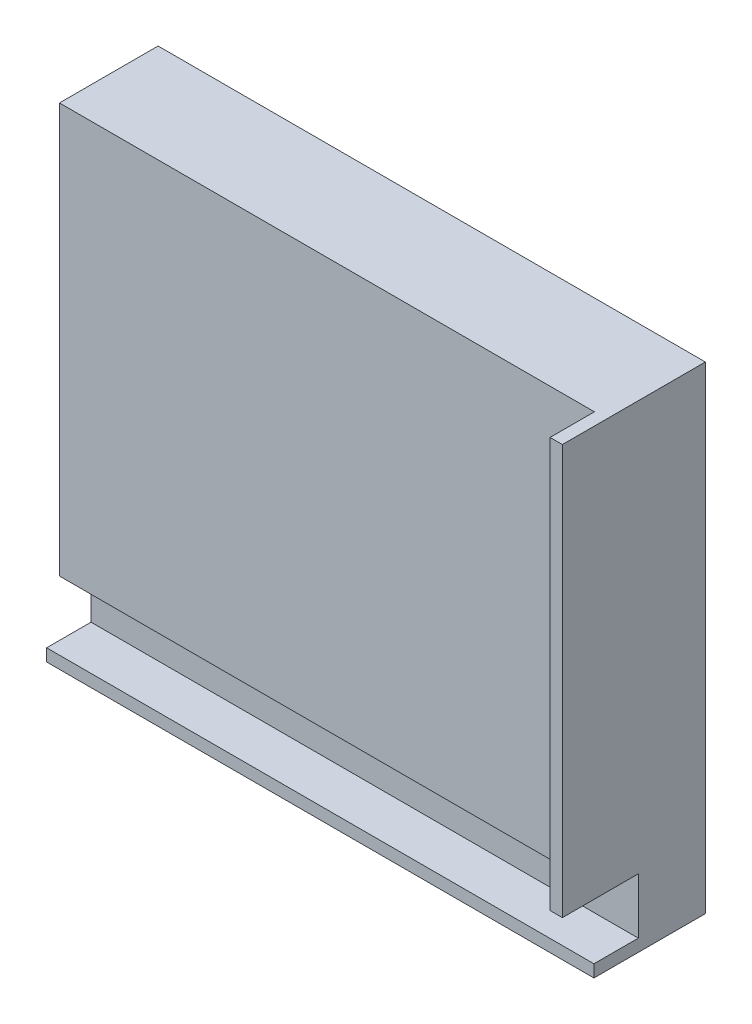
ISO-10303-21;
HEADER;
FILE_DESCRIPTION(('STEP AP214'),'2;1');
FILE_NAME('part.step','',(''),(''),'','','');
FILE_SCHEMA(('AUTOMOTIVE_DESIGN { 1 0 10303 214 1 1 1 1 }'));
ENDSEC;
DATA;
#1=APPLICATION_CONTEXT('core data for automotive mechanical design processes');
#2=APPLICATION_PROTOCOL_DEFINITION('international standard','automotive_design',2000,#1);
#3=PRODUCT_CONTEXT('',#1,'mechanical');
#4=PRODUCT('Part','Part','',(#3));
#5=PRODUCT_RELATED_PRODUCT_CATEGORY('part','',(#4));
#6=PRODUCT_DEFINITION_FORMATION('','',#4);
#7=PRODUCT_DEFINITION_CONTEXT('part definition',#1,'design');
#8=PRODUCT_DEFINITION('design','',#6,#7);
#9=PRODUCT_DEFINITION_SHAPE('','',#8);
#10=(LENGTH_UNIT() NAMED_UNIT(*) SI_UNIT(.MILLI.,.METRE.));
#11=(NAMED_UNIT(*) PLANE_ANGLE_UNIT() SI_UNIT($,.RADIAN.));
#12=(NAMED_UNIT(*) SI_UNIT($,.STERADIAN.) SOLID_ANGLE_UNIT());
#13=UNCERTAINTY_MEASURE_WITH_UNIT(LENGTH_MEASURE(1.E-05),#10,'distance_accuracy_value','');
#14=(GEOMETRIC_REPRESENTATION_CONTEXT(3) GLOBAL_UNCERTAINTY_ASSIGNED_CONTEXT((#13)) GLOBAL_UNIT_ASSIGNED_CONTEXT((#10,
#11,#12)) REPRESENTATION_CONTEXT('',''));
#15=CARTESIAN_POINT('',(0.,0.,0.));
#16=DIRECTION('',(0.,0.,1.));
#17=DIRECTION('',(1.,0.,0.));
#18=AXIS2_PLACEMENT_3D('',#15,#16,#17);
#19=CARTESIAN_POINT('',(72.5968292682926,25.1026341463416,36.83));
#20=DIRECTION('',(0.,-1.,0.));
#21=DIRECTION('',(0.,0.,-1.));
#22=AXIS2_PLACEMENT_3D('',#19,#20,#21);
#23=PLANE('',#22);
#24=DIRECTION('',(0.,0.,1.));
#25=VECTOR('',#24,1.);
#26=CARTESIAN_POINT('',(72.6068292682926,25.1026341463416,36.84));
#27=LINE('',#26,#25);
#28=CARTESIAN_POINT('',(72.6068292682926,25.1026341463416,0.));
#29=VERTEX_POINT('',#28);
#30=CARTESIAN_POINT('',(72.6068292682926,25.1026341463416,25.4));
#31=VERTEX_POINT('',#30);
#32=EDGE_CURVE('E41',#29,#31,#27,.T.);
#33=ORIENTED_EDGE('',*,*,#32,.T.);
#34=DIRECTION('',(1.,0.,0.));
#35=VECTOR('',#34,1.);
#36=CARTESIAN_POINT('',(0.,25.1026341463416,25.4));
#37=LINE('',#36,#35);
#38=CARTESIAN_POINT('',(210.401829268293,25.1026341463416,25.4));
#39=VERTEX_POINT('',#38);
#40=EDGE_CURVE('E46',#31,#39,#37,.T.);
#41=ORIENTED_EDGE('',*,*,#40,.T.);
#42=DIRECTION('',(0.,0.,1.));
#43=VECTOR('',#42,1.);
#44=CARTESIAN_POINT('',(210.401829268293,25.1026341463416,0.));
#45=LINE('',#44,#43);
#46=CARTESIAN_POINT('',(210.401829268293,25.1026341463416,36.83));
#47=VERTEX_POINT('',#46);
#48=EDGE_CURVE('E170',#39,#47,#45,.T.);
#49=ORIENTED_EDGE('',*,*,#48,.T.);
#50=DIRECTION('',(1.,0.,0.));
#51=VECTOR('',#50,1.);
#52=CARTESIAN_POINT('',(213.576829268293,25.1026341463416,36.83));
#53=LINE('',#52,#51);
#54=CARTESIAN_POINT('',(213.576829268293,25.1026341463416,36.83));
#55=VERTEX_POINT('',#54);
#56=EDGE_CURVE('E11',#47,#55,#53,.T.);
#57=ORIENTED_EDGE('',*,*,#56,.T.);
#58=DIRECTION('',(0.,0.,-1.));
#59=VECTOR('',#58,1.);
#60=CARTESIAN_POINT('',(213.576829268293,25.1026341463416,28.702));
#61=LINE('',#60,#59);
#62=CARTESIAN_POINT('',(213.576829268293,25.1026341463416,0.));
#63=VERTEX_POINT('',#62);
#64=EDGE_CURVE('E60',#55,#63,#61,.T.);
#65=ORIENTED_EDGE('',*,*,#64,.T.);
#66=DIRECTION('',(1.,0.,0.));
#67=VECTOR('',#66,1.);
#68=CARTESIAN_POINT('',(0.,25.1026341463416,0.));
#69=LINE('',#68,#67);
#70=EDGE_CURVE('E166',#29,#63,#69,.T.);
#71=ORIENTED_EDGE('',*,*,#70,.F.);
#72=EDGE_LOOP('',(#33,#41,#49,#57,#65,#71));
#73=FACE_BOUND('',#72,.T.);
#74=ADVANCED_FACE('F38',(#73),#23,.F.);
#75=CARTESIAN_POINT('',(-68.3631707317073,-94.7853658536585,28.702));
#76=DIRECTION('',(0.,0.,1.));
#77=DIRECTION('',(1.,0.,0.));
#78=AXIS2_PLACEMENT_3D('',#75,#76,#77);
#79=PLANE('',#78);
#80=DIRECTION('',(-1.,0.,0.));
#81=VECTOR('',#80,1.);
#82=CARTESIAN_POINT('',(-68.3631707317073,-94.7853658536585,28.702));
#83=LINE('',#82,#81);
#84=CARTESIAN_POINT('',(213.576829268293,-94.7853658536585,28.702));
#85=VERTEX_POINT('',#84);
#86=CARTESIAN_POINT('',(72.6068292682926,-94.7853658536585,28.702));
#87=VERTEX_POINT('',#86);
#88=EDGE_CURVE('E151',#85,#87,#83,.T.);
#89=ORIENTED_EDGE('',*,*,#88,.T.);
#90=DIRECTION('',(0.,-1.,0.));
#91=VECTOR('',#90,1.);
#92=CARTESIAN_POINT('',(72.6068292682926,-94.7853658536585,28.702));
#93=LINE('',#92,#91);
#94=CARTESIAN_POINT('',(72.6068292682926,-97.9603658536585,28.702));
#95=VERTEX_POINT('',#94);
#96=EDGE_CURVE('E184',#87,#95,#93,.T.);
#97=ORIENTED_EDGE('',*,*,#96,.T.);
#98=DIRECTION('',(-1.,0.,0.));
#99=VECTOR('',#98,1.);
#100=CARTESIAN_POINT('',(-68.3631707317073,-97.9603658536585,28.702));
#101=LINE('',#100,#99);
#102=CARTESIAN_POINT('',(213.576829268293,-97.9603658536585,28.702));
#103=VERTEX_POINT('',#102);
#104=EDGE_CURVE('E157',#103,#95,#101,.T.);
#105=ORIENTED_EDGE('',*,*,#104,.F.);
#106=DIRECTION('',(0.,-1.,0.));
#107=VECTOR('',#106,1.);
#108=CARTESIAN_POINT('',(213.576829268293,-94.7853658536585,28.702));
#109=LINE('',#108,#107);
#110=EDGE_CURVE('E126',#85,#103,#109,.T.);
#111=ORIENTED_EDGE('',*,*,#110,.F.);
#112=EDGE_LOOP('',(#89,#97,#105,#111));
#113=FACE_BOUND('',#112,.T.);
#114=ADVANCED_FACE('F199',(#113),#79,.T.);
#115=CARTESIAN_POINT('',(0.,-94.7853658536585,0.));
#116=DIRECTION('',(0.,1.,0.));
#117=DIRECTION('',(0.,0.,1.));
#118=AXIS2_PLACEMENT_3D('',#115,#116,#117);
#119=PLANE('',#118);
#120=DIRECTION('',(1.,0.,0.));
#121=VECTOR('',#120,1.);
#122=CARTESIAN_POINT('',(213.576829268293,-94.7853658536585,17.272));
#123=LINE('',#122,#121);
#124=CARTESIAN_POINT('',(72.6068292682926,-94.7853658536585,17.272));
#125=VERTEX_POINT('',#124);
#126=CARTESIAN_POINT('',(213.576829268293,-94.7853658536585,17.272));
#127=VERTEX_POINT('',#126);
#128=EDGE_CURVE('E155',#125,#127,#123,.T.);
#129=ORIENTED_EDGE('',*,*,#128,.F.);
#130=DIRECTION('',(0.,0.,1.));
#131=VECTOR('',#130,1.);
#132=CARTESIAN_POINT('',(72.6068292682926,-94.7853658536585,0.));
#133=LINE('',#132,#131);
#134=EDGE_CURVE('E127',#125,#87,#133,.T.);
#135=ORIENTED_EDGE('',*,*,#134,.T.);
#136=ORIENTED_EDGE('',*,*,#88,.F.);
#137=DIRECTION('',(0.,0.,1.));
#138=VECTOR('',#137,1.);
#139=CARTESIAN_POINT('',(213.576829268293,-94.7853658536585,28.702));
#140=LINE('',#139,#138);
#141=EDGE_CURVE('E154',#127,#85,#140,.T.);
#142=ORIENTED_EDGE('',*,*,#141,.F.);
#143=EDGE_LOOP('',(#129,#135,#136,#142));
#144=FACE_BOUND('',#143,.T.);
#145=ADVANCED_FACE('F204',(#144),#119,.T.);
#146=CARTESIAN_POINT('',(0.,0.,17.272));
#147=DIRECTION('',(0.,0.,-1.));
#148=DIRECTION('',(-1.,0.,0.));
#149=AXIS2_PLACEMENT_3D('',#146,#147,#148);
#150=PLANE('',#149);
#151=DIRECTION('',(0.,1.,0.));
#152=VECTOR('',#151,1.);
#153=CARTESIAN_POINT('',(72.6068292682926,0.,17.272));
#154=LINE('',#153,#152);
#155=CARTESIAN_POINT('',(72.6068292682926,-80.4343658536585,17.272));
#156=VERTEX_POINT('',#155);
#157=EDGE_CURVE('E145',#125,#156,#154,.T.);
#158=ORIENTED_EDGE('',*,*,#157,.F.);
#159=ORIENTED_EDGE('',*,*,#128,.T.);
#160=DIRECTION('',(0.,1.,0.));
#161=VECTOR('',#160,1.);
#162=CARTESIAN_POINT('',(213.576829268293,-80.4343658536585,17.272));
#163=LINE('',#162,#161);
#164=CARTESIAN_POINT('',(213.576829268293,-80.4343658536585,17.272));
#165=VERTEX_POINT('',#164);
#166=EDGE_CURVE('E139',#127,#165,#163,.T.);
#167=ORIENTED_EDGE('',*,*,#166,.T.);
#168=DIRECTION('',(-1.,0.,0.));
#169=VECTOR('',#168,1.);
#170=CARTESIAN_POINT('',(-68.3631707317074,-80.4343658536585,17.272));
#171=LINE('',#170,#169);
#172=EDGE_CURVE('E164',#165,#156,#171,.T.);
#173=ORIENTED_EDGE('',*,*,#172,.T.);
#174=EDGE_LOOP('',(#158,#159,#167,#173));
#175=FACE_BOUND('',#174,.T.);
#176=ADVANCED_FACE('F217',(#175),#150,.F.);
#177=CARTESIAN_POINT('',(0.,-97.9603658536585,0.));
#178=DIRECTION('',(0.,1.,0.));
#179=DIRECTION('',(0.,0.,1.));
#180=AXIS2_PLACEMENT_3D('',#177,#178,#179);
#181=PLANE('',#180);
#182=DIRECTION('',(0.,0.,1.));
#183=VECTOR('',#182,1.);
#184=CARTESIAN_POINT('',(72.6068292682926,-97.9603658536585,0.));
#185=LINE('',#184,#183);
#186=CARTESIAN_POINT('',(72.6068292682926,-97.9603658536585,0.));
#187=VERTEX_POINT('',#186);
#188=EDGE_CURVE('E187',#187,#95,#185,.T.);
#189=ORIENTED_EDGE('',*,*,#188,.F.);
#190=DIRECTION('',(1.,0.,0.));
#191=VECTOR('',#190,1.);
#192=CARTESIAN_POINT('',(-68.3631707317073,-97.9603658536585,0.));
#193=LINE('',#192,#191);
#194=CARTESIAN_POINT('',(213.576829268293,-97.9603658536585,0.));
#195=VERTEX_POINT('',#194);
#196=EDGE_CURVE('E160',#187,#195,#193,.T.);
#197=ORIENTED_EDGE('',*,*,#196,.T.);
#198=DIRECTION('',(0.,0.,1.));
#199=VECTOR('',#198,1.);
#200=CARTESIAN_POINT('',(213.576829268293,-97.9603658536585,28.702));
#201=LINE('',#200,#199);
#202=EDGE_CURVE('E159',#195,#103,#201,.T.);
#203=ORIENTED_EDGE('',*,*,#202,.T.);
#204=ORIENTED_EDGE('',*,*,#104,.T.);
#205=EDGE_LOOP('',(#189,#197,#203,#204));
#206=FACE_BOUND('',#205,.T.);
#207=ADVANCED_FACE('F194',(#206),#181,.F.);
#208=CARTESIAN_POINT('',(213.576829268293,-94.7853658536585,28.702));
#209=DIRECTION('',(1.,0.,0.));
#210=DIRECTION('',(0.,0.,-1.));
#211=AXIS2_PLACEMENT_3D('',#208,#209,#210);
#212=PLANE('',#211);
#213=ORIENTED_EDGE('',*,*,#64,.F.);
#214=DIRECTION('',(0.,1.,0.));
#215=VECTOR('',#214,1.);
#216=CARTESIAN_POINT('',(213.576829268293,127.464634146342,36.83));
#217=LINE('',#216,#215);
#218=CARTESIAN_POINT('',(213.576829268293,-80.4343658536585,36.83));
#219=VERTEX_POINT('',#218);
#220=EDGE_CURVE('E138',#219,#55,#217,.T.);
#221=ORIENTED_EDGE('',*,*,#220,.F.);
#222=DIRECTION('',(0.,0.,1.));
#223=VECTOR('',#222,1.);
#224=CARTESIAN_POINT('',(213.576829268293,-80.4343658536585,17.272));
#225=LINE('',#224,#223);
#226=EDGE_CURVE('E162',#165,#219,#225,.T.);
#227=ORIENTED_EDGE('',*,*,#226,.F.);
#228=ORIENTED_EDGE('',*,*,#166,.F.);
#229=ORIENTED_EDGE('',*,*,#141,.T.);
#230=ORIENTED_EDGE('',*,*,#110,.T.);
#231=ORIENTED_EDGE('',*,*,#202,.F.);
#232=DIRECTION('',(0.,1.,0.));
#233=VECTOR('',#232,1.);
#234=CARTESIAN_POINT('',(213.576829268293,130.639634146342,0.));
#235=LINE('',#234,#233);
#236=EDGE_CURVE('E163',#195,#63,#235,.T.);
#237=ORIENTED_EDGE('',*,*,#236,.T.);
#238=EDGE_LOOP('',(#213,#221,#227,#228,#229,#230,#231,#237));
#239=FACE_BOUND('',#238,.T.);
#240=ADVANCED_FACE('F206',(#239),#212,.T.);
#241=CARTESIAN_POINT('',(72.6068292682926,-97.9603658536585,36.84));
#242=DIRECTION('',(-1.,0.,0.));
#243=DIRECTION('',(0.,-1.,0.));
#244=AXIS2_PLACEMENT_3D('',#241,#242,#243);
#245=PLANE('',#244);
#246=ORIENTED_EDGE('',*,*,#32,.F.);
#247=DIRECTION('',(0.,-1.,0.));
#248=VECTOR('',#247,1.);
#249=CARTESIAN_POINT('',(72.6068292682926,0.,0.));
#250=LINE('',#249,#248);
#251=EDGE_CURVE('E146',#29,#187,#250,.T.);
#252=ORIENTED_EDGE('',*,*,#251,.T.);
#253=ORIENTED_EDGE('',*,*,#188,.T.);
#254=ORIENTED_EDGE('',*,*,#96,.F.);
#255=ORIENTED_EDGE('',*,*,#134,.F.);
#256=ORIENTED_EDGE('',*,*,#157,.T.);
#257=DIRECTION('',(0.,0.,1.));
#258=VECTOR('',#257,1.);
#259=CARTESIAN_POINT('',(72.6068292682926,-80.4343658536585,17.272));
#260=LINE('',#259,#258);
#261=CARTESIAN_POINT('',(72.6068292682926,-80.4343658536585,25.4));
#262=VERTEX_POINT('',#261);
#263=EDGE_CURVE('E134',#156,#262,#260,.T.);
#264=ORIENTED_EDGE('',*,*,#263,.T.);
#265=DIRECTION('',(0.,-1.,0.));
#266=VECTOR('',#265,1.);
#267=CARTESIAN_POINT('',(72.6068292682926,0.,25.4));
#268=LINE('',#267,#266);
#269=EDGE_CURVE('E116',#31,#262,#268,.T.);
#270=ORIENTED_EDGE('',*,*,#269,.F.);
#271=EDGE_LOOP('',(#246,#252,#253,#254,#255,#256,#264,#270));
#272=FACE_BOUND('',#271,.T.);
#273=ADVANCED_FACE('F142',(#272),#245,.T.);
#274=CARTESIAN_POINT('',(0.,0.,0.));
#275=DIRECTION('',(0.,0.,1.));
#276=DIRECTION('',(1.,0.,0.));
#277=AXIS2_PLACEMENT_3D('',#274,#275,#276);
#278=PLANE('',#277);
#279=ORIENTED_EDGE('',*,*,#251,.F.);
#280=ORIENTED_EDGE('',*,*,#70,.T.);
#281=ORIENTED_EDGE('',*,*,#236,.F.);
#282=ORIENTED_EDGE('',*,*,#196,.F.);
#283=EDGE_LOOP('',(#279,#280,#281,#282));
#284=FACE_BOUND('',#283,.T.);
#285=ADVANCED_FACE('F237',(#284),#278,.F.);
#286=CARTESIAN_POINT('',(-68.3631707317074,-80.4343658536585,17.272));
#287=DIRECTION('',(0.,1.,0.));
#288=DIRECTION('',(0.,0.,1.));
#289=AXIS2_PLACEMENT_3D('',#286,#287,#288);
#290=PLANE('',#289);
#291=ORIENTED_EDGE('',*,*,#263,.F.);
#292=ORIENTED_EDGE('',*,*,#172,.F.);
#293=ORIENTED_EDGE('',*,*,#226,.T.);
#294=DIRECTION('',(1.,0.,0.));
#295=VECTOR('',#294,1.);
#296=CARTESIAN_POINT('',(210.401829268293,-80.4343658536585,36.83));
#297=LINE('',#296,#295);
#298=CARTESIAN_POINT('',(210.401829268293,-80.4343658536585,36.83));
#299=VERTEX_POINT('',#298);
#300=EDGE_CURVE('E179',#299,#219,#297,.T.);
#301=ORIENTED_EDGE('',*,*,#300,.F.);
#302=DIRECTION('',(0.,0.,-1.));
#303=VECTOR('',#302,1.);
#304=CARTESIAN_POINT('',(210.401829268293,-80.4343658536585,25.4));
#305=LINE('',#304,#303);
#306=CARTESIAN_POINT('',(210.401829268293,-80.4343658536585,25.4));
#307=VERTEX_POINT('',#306);
#308=EDGE_CURVE('E137',#299,#307,#305,.T.);
#309=ORIENTED_EDGE('',*,*,#308,.T.);
#310=DIRECTION('',(-1.,0.,0.));
#311=VECTOR('',#310,1.);
#312=CARTESIAN_POINT('',(-68.3631707317074,-80.4343658536585,25.4));
#313=LINE('',#312,#311);
#314=EDGE_CURVE('E120',#307,#262,#313,.T.);
#315=ORIENTED_EDGE('',*,*,#314,.T.);
#316=EDGE_LOOP('',(#291,#292,#293,#301,#309,#315));
#317=FACE_BOUND('',#316,.T.);
#318=ADVANCED_FACE('F132',(#317),#290,.F.);
#319=CARTESIAN_POINT('',(210.401829268293,0.,0.));
#320=DIRECTION('',(-1.,0.,0.));
#321=DIRECTION('',(0.,0.,1.));
#322=AXIS2_PLACEMENT_3D('',#319,#320,#321);
#323=PLANE('',#322);
#324=ORIENTED_EDGE('',*,*,#48,.F.);
#325=DIRECTION('',(0.,1.,0.));
#326=VECTOR('',#325,1.);
#327=CARTESIAN_POINT('',(210.401829268293,127.464634146342,25.4));
#328=LINE('',#327,#326);
#329=EDGE_CURVE('E167',#307,#39,#328,.T.);
#330=ORIENTED_EDGE('',*,*,#329,.F.);
#331=ORIENTED_EDGE('',*,*,#308,.F.);
#332=DIRECTION('',(0.,-1.,0.));
#333=VECTOR('',#332,1.);
#334=CARTESIAN_POINT('',(210.401829268293,-80.4343658536585,36.83));
#335=LINE('',#334,#333);
#336=EDGE_CURVE('E174',#47,#299,#335,.T.);
#337=ORIENTED_EDGE('',*,*,#336,.F.);
#338=EDGE_LOOP('',(#324,#330,#331,#337));
#339=FACE_BOUND('',#338,.T.);
#340=ADVANCED_FACE('F175',(#339),#323,.T.);
#341=CARTESIAN_POINT('',(213.576829268293,127.464634146342,36.83));
#342=DIRECTION('',(0.,0.,1.));
#343=DIRECTION('',(1.,0.,0.));
#344=AXIS2_PLACEMENT_3D('',#341,#342,#343);
#345=PLANE('',#344);
#346=ORIENTED_EDGE('',*,*,#56,.F.);
#347=ORIENTED_EDGE('',*,*,#336,.T.);
#348=ORIENTED_EDGE('',*,*,#300,.T.);
#349=ORIENTED_EDGE('',*,*,#220,.T.);
#350=EDGE_LOOP('',(#346,#347,#348,#349));
#351=FACE_BOUND('',#350,.T.);
#352=ADVANCED_FACE('F215',(#351),#345,.T.);
#353=CARTESIAN_POINT('',(0.,0.,25.4));
#354=DIRECTION('',(0.,0.,1.));
#355=DIRECTION('',(1.,0.,0.));
#356=AXIS2_PLACEMENT_3D('',#353,#354,#355);
#357=PLANE('',#356);
#358=ORIENTED_EDGE('',*,*,#40,.F.);
#359=ORIENTED_EDGE('',*,*,#269,.T.);
#360=ORIENTED_EDGE('',*,*,#314,.F.);
#361=ORIENTED_EDGE('',*,*,#329,.T.);
#362=EDGE_LOOP('',(#358,#359,#360,#361));
#363=FACE_BOUND('',#362,.T.);
#364=ADVANCED_FACE('F118',(#363),#357,.T.);
#365=CLOSED_SHELL('',(#74,#114,#145,#176,#207,#240,#273,#285,#318,#340,#352,#364));
#366=MANIFOLD_SOLID_BREP('B2',#365);
#367=ADVANCED_BREP_SHAPE_REPRESENTATION('',(#18,#366),#14);
#368=SHAPE_DEFINITION_REPRESENTATION(#9,#367);
ENDSEC;
END-ISO-10303-21;
